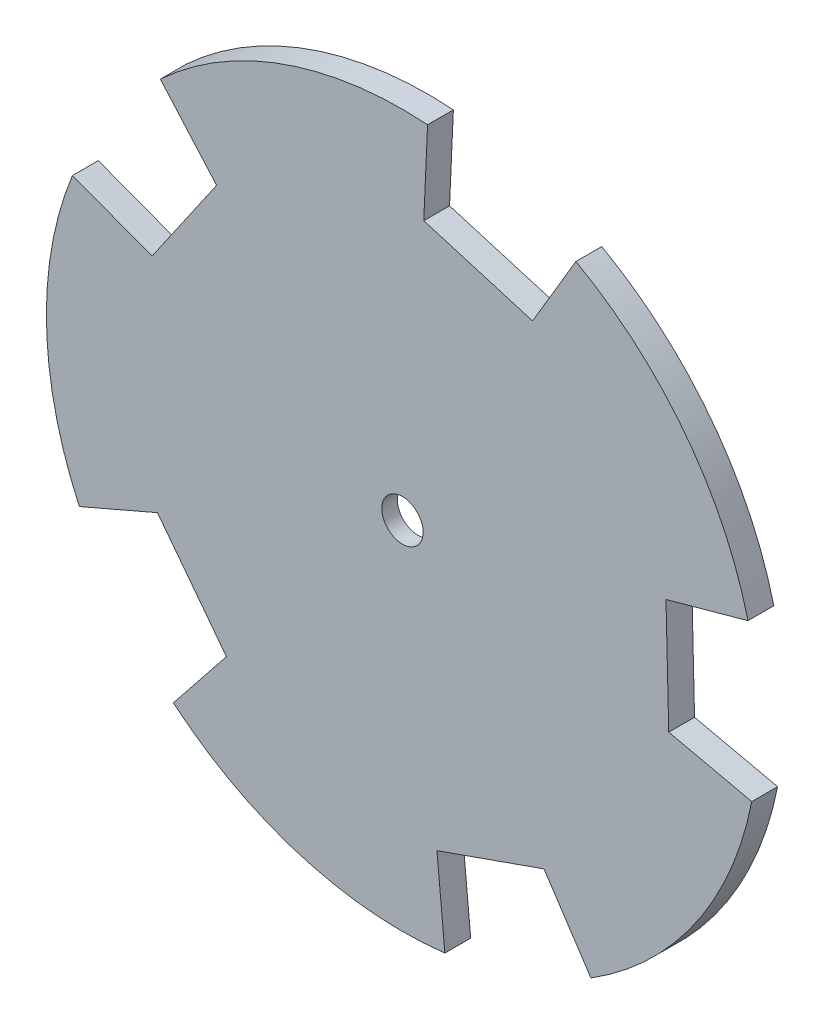
ISO-10303-21;
HEADER;
FILE_DESCRIPTION(('STEP AP214'),'2;1');
FILE_NAME('part.step','',(''),(''),'','','');
FILE_SCHEMA(('AUTOMOTIVE_DESIGN { 1 0 10303 214 1 1 1 1 }'));
ENDSEC;
DATA;
#1=APPLICATION_CONTEXT('core data for automotive mechanical design processes');
#2=APPLICATION_PROTOCOL_DEFINITION('international standard','automotive_design',2000,#1);
#3=PRODUCT_CONTEXT('',#1,'mechanical');
#4=PRODUCT('Part','Part','',(#3));
#5=PRODUCT_RELATED_PRODUCT_CATEGORY('part','',(#4));
#6=PRODUCT_DEFINITION_FORMATION('','',#4);
#7=PRODUCT_DEFINITION_CONTEXT('part definition',#1,'design');
#8=PRODUCT_DEFINITION('design','',#6,#7);
#9=PRODUCT_DEFINITION_SHAPE('','',#8);
#10=(LENGTH_UNIT() NAMED_UNIT(*) SI_UNIT(.MILLI.,.METRE.));
#11=(NAMED_UNIT(*) PLANE_ANGLE_UNIT() SI_UNIT($,.RADIAN.));
#12=(NAMED_UNIT(*) SI_UNIT($,.STERADIAN.) SOLID_ANGLE_UNIT());
#13=UNCERTAINTY_MEASURE_WITH_UNIT(LENGTH_MEASURE(1.E-05),#10,'distance_accuracy_value','');
#14=(GEOMETRIC_REPRESENTATION_CONTEXT(3) GLOBAL_UNCERTAINTY_ASSIGNED_CONTEXT((#13)) GLOBAL_UNIT_ASSIGNED_CONTEXT((#10,
#11,#12)) REPRESENTATION_CONTEXT('',''));
#15=CARTESIAN_POINT('',(0.,0.,0.));
#16=DIRECTION('',(0.,0.,1.));
#17=DIRECTION('',(1.,0.,0.));
#18=AXIS2_PLACEMENT_3D('',#15,#16,#17);
#19=CARTESIAN_POINT('',(0.,0.,1.5));
#20=DIRECTION('',(0.,0.,-1.));
#21=DIRECTION('',(-1.,0.,0.));
#22=AXIS2_PLACEMENT_3D('',#19,#20,#21);
#23=CYLINDRICAL_SURFACE('',#22,34.5);
#24=DIRECTION('',(0.,0.,-1.));
#25=VECTOR('',#24,1.);
#26=CARTESIAN_POINT('',(2.43311260345727,34.4140954124745,1.5));
#27=LINE('',#26,#25);
#28=CARTESIAN_POINT('',(2.43311260345727,34.4140954124745,1.5));
#29=VERTEX_POINT('',#28);
#30=CARTESIAN_POINT('',(2.43311260345728,34.4140954124745,-1.));
#31=VERTEX_POINT('',#30);
#32=EDGE_CURVE('E176',#29,#31,#27,.T.);
#33=ORIENTED_EDGE('',*,*,#32,.T.);
#34=CARTESIAN_POINT('',(0.,0.,-1.));
#35=DIRECTION('',(0.,0.,1.));
#36=DIRECTION('',(1.,0.,0.));
#37=AXIS2_PLACEMENT_3D('',#34,#35,#36);
#38=CIRCLE('',#37,34.5);
#39=CARTESIAN_POINT('',(-23.4602203749444,25.29561345291,-1.));
#40=VERTEX_POINT('',#39);
#41=EDGE_CURVE('E187',#31,#40,#38,.T.);
#42=ORIENTED_EDGE('',*,*,#41,.T.);
#43=DIRECTION('',(0.,0.,-1.));
#44=VECTOR('',#43,1.);
#45=CARTESIAN_POINT('',(-23.4602203749444,25.29561345291,1.5));
#46=LINE('',#45,#44);
#47=CARTESIAN_POINT('',(-23.4602203749444,25.29561345291,1.5));
#48=VERTEX_POINT('',#47);
#49=EDGE_CURVE('E11',#48,#40,#46,.T.);
#50=ORIENTED_EDGE('',*,*,#49,.F.);
#51=CARTESIAN_POINT('',(0.,0.,1.5));
#52=DIRECTION('',(0.,0.,1.));
#53=DIRECTION('',(1.,0.,0.));
#54=AXIS2_PLACEMENT_3D('',#51,#52,#53);
#55=CIRCLE('',#54,34.5);
#56=EDGE_CURVE('E247',#29,#48,#55,.T.);
#57=ORIENTED_EDGE('',*,*,#56,.F.);
#58=EDGE_LOOP('',(#33,#42,#50,#57));
#59=FACE_BOUND('',#58,.T.);
#60=ADVANCED_FACE('F35',(#59),#23,.T.);
#61=CARTESIAN_POINT('',(-23.4602203749444,25.29561345291,1.5));
#62=DIRECTION('',(0.750529244150338,0.660837236901131,0.));
#63=DIRECTION('',(-0.660837236901131,0.750529244150338,0.));
#64=AXIS2_PLACEMENT_3D('',#61,#62,#63);
#65=PLANE('',#64);
#66=ORIENTED_EDGE('',*,*,#49,.T.);
#67=DIRECTION('',(0.660837236901131,-0.750529244150338,0.));
#68=VECTOR('',#67,1.);
#69=CARTESIAN_POINT('',(-18.0108169167751,19.1065907554164,-1.));
#70=LINE('',#69,#68);
#71=CARTESIAN_POINT('',(-18.0108169167751,19.1065907554164,-1.00000000000003));
#72=VERTEX_POINT('',#71);
#73=EDGE_CURVE('E241',#40,#72,#70,.T.);
#74=ORIENTED_EDGE('',*,*,#73,.T.);
#75=DIRECTION('',(0.,0.,-1.));
#76=VECTOR('',#75,1.);
#77=CARTESIAN_POINT('',(-18.0108169167751,19.1065907554164,1.5));
#78=LINE('',#77,#76);
#79=CARTESIAN_POINT('',(-18.0108169167751,19.1065907554164,1.5));
#80=VERTEX_POINT('',#79);
#81=EDGE_CURVE('E42',#80,#72,#78,.T.);
#82=ORIENTED_EDGE('',*,*,#81,.F.);
#83=DIRECTION('',(0.660837236901131,-0.750529244150338,0.));
#84=VECTOR('',#83,1.);
#85=CARTESIAN_POINT('',(-23.4602203749444,25.29561345291,1.5));
#86=LINE('',#85,#84);
#87=EDGE_CURVE('E249',#48,#80,#86,.T.);
#88=ORIENTED_EDGE('',*,*,#87,.F.);
#89=EDGE_LOOP('',(#66,#74,#82,#88));
#90=FACE_BOUND('',#89,.T.);
#91=ADVANCED_FACE('F325',(#90),#65,.F.);
#92=CARTESIAN_POINT('',(-18.0108169167751,19.1065907554164,1.5));
#93=DIRECTION('',(0.823136368534445,-0.567843745053097,0.));
#94=DIRECTION('',(0.567843745053097,0.823136368534445,0.));
#95=AXIS2_PLACEMENT_3D('',#92,#93,#94);
#96=PLANE('',#95);
#97=ORIENTED_EDGE('',*,*,#81,.T.);
#98=DIRECTION('',(-0.567843745053097,-0.823136368534445,0.));
#99=VECTOR('',#98,1.);
#100=CARTESIAN_POINT('',(-24.2570981123591,10.0520907015375,-1.));
#101=LINE('',#100,#99);
#102=CARTESIAN_POINT('',(-24.2570981123591,10.0520907015375,-1.));
#103=VERTEX_POINT('',#102);
#104=EDGE_CURVE('E238',#72,#103,#101,.T.);
#105=ORIENTED_EDGE('',*,*,#104,.T.);
#106=DIRECTION('',(0.,0.,-1.));
#107=VECTOR('',#106,1.);
#108=CARTESIAN_POINT('',(-24.2570981123591,10.0520907015375,1.5));
#109=LINE('',#108,#107);
#110=CARTESIAN_POINT('',(-24.2570981123591,10.0520907015375,1.5));
#111=VERTEX_POINT('',#110);
#112=EDGE_CURVE('E315',#111,#103,#109,.T.);
#113=ORIENTED_EDGE('',*,*,#112,.F.);
#114=DIRECTION('',(-0.567843745053097,-0.823136368534445,0.));
#115=VECTOR('',#114,1.);
#116=CARTESIAN_POINT('',(-18.0108169167751,19.1065907554164,1.5));
#117=LINE('',#116,#115);
#118=EDGE_CURVE('E251',#80,#111,#117,.T.);
#119=ORIENTED_EDGE('',*,*,#118,.F.);
#120=EDGE_LOOP('',(#97,#105,#113,#119));
#121=FACE_BOUND('',#120,.T.);
#122=ADVANCED_FACE('F320',(#121),#96,.F.);
#123=CARTESIAN_POINT('',(-24.2570981123591,10.0520907015375,1.5));
#124=DIRECTION('',(-0.351249456885061,-0.936281912159981,0.));
#125=DIRECTION('',(0.936281912159981,-0.351249456885061,0.));
#126=AXIS2_PLACEMENT_3D('',#123,#124,#125);
#127=PLANE('',#126);
#128=ORIENTED_EDGE('',*,*,#112,.T.);
#129=DIRECTION('',(-0.93628191215998,0.351249456885062,0.));
#130=VECTOR('',#129,1.);
#131=CARTESIAN_POINT('',(-31.9778765507409,12.9485679248934,-1.));
#132=LINE('',#131,#130);
#133=CARTESIAN_POINT('',(-31.9778765507409,12.9485679248934,-1.));
#134=VERTEX_POINT('',#133);
#135=EDGE_CURVE('E235',#103,#134,#132,.T.);
#136=ORIENTED_EDGE('',*,*,#135,.T.);
#137=DIRECTION('',(0.,0.,-1.));
#138=VECTOR('',#137,1.);
#139=CARTESIAN_POINT('',(-31.9778765507409,12.9485679248933,1.5));
#140=LINE('',#139,#138);
#141=CARTESIAN_POINT('',(-31.9778765507409,12.9485679248933,1.5));
#142=VERTEX_POINT('',#141);
#143=EDGE_CURVE('E313',#142,#134,#140,.T.);
#144=ORIENTED_EDGE('',*,*,#143,.F.);
#145=DIRECTION('',(-0.93628191215998,0.351249456885061,0.));
#146=VECTOR('',#145,1.);
#147=CARTESIAN_POINT('',(-24.2570981123591,10.0520907015375,1.5));
#148=LINE('',#147,#146);
#149=EDGE_CURVE('E253',#111,#142,#148,.T.);
#150=ORIENTED_EDGE('',*,*,#149,.F.);
#151=EDGE_LOOP('',(#128,#136,#144,#150));
#152=FACE_BOUND('',#151,.T.);
#153=ADVANCED_FACE('F373',(#152),#127,.F.);
#154=CARTESIAN_POINT('',(0.,0.,1.5));
#155=DIRECTION('',(0.,0.,-1.));
#156=DIRECTION('',(-1.,0.,0.));
#157=AXIS2_PLACEMENT_3D('',#154,#155,#156);
#158=CYLINDRICAL_SURFACE('',#157,34.5);
#159=ORIENTED_EDGE('',*,*,#143,.T.);
#160=CARTESIAN_POINT('',(0.,0.,-1.));
#161=DIRECTION('',(0.,0.,1.));
#162=DIRECTION('',(1.,0.,0.));
#163=AXIS2_PLACEMENT_3D('',#160,#161,#162);
#164=CIRCLE('',#163,34.5);
#165=CARTESIAN_POINT('',(-31.3071647957126,-14.4952210212226,-1.));
#166=VERTEX_POINT('',#165);
#167=EDGE_CURVE('E232',#134,#166,#164,.T.);
#168=ORIENTED_EDGE('',*,*,#167,.T.);
#169=DIRECTION('',(0.,0.,-1.));
#170=VECTOR('',#169,1.);
#171=CARTESIAN_POINT('',(-31.3071647957126,-14.4952210212225,1.5));
#172=LINE('',#171,#170);
#173=CARTESIAN_POINT('',(-31.3071647957126,-14.4952210212225,1.5));
#174=VERTEX_POINT('',#173);
#175=EDGE_CURVE('E311',#174,#166,#172,.T.);
#176=ORIENTED_EDGE('',*,*,#175,.F.);
#177=CARTESIAN_POINT('',(0.,0.,1.5));
#178=DIRECTION('',(0.,0.,1.));
#179=DIRECTION('',(1.,0.,0.));
#180=AXIS2_PLACEMENT_3D('',#177,#178,#179);
#181=CIRCLE('',#180,34.5);
#182=EDGE_CURVE('E255',#142,#174,#181,.T.);
#183=ORIENTED_EDGE('',*,*,#182,.F.);
#184=EDGE_LOOP('',(#159,#168,#176,#183));
#185=FACE_BOUND('',#184,.T.);
#186=ADVANCED_FACE('F378',(#185),#158,.T.);
#187=CARTESIAN_POINT('',(-31.3071647957126,-14.4952210212226,1.5));
#188=DIRECTION('',(-0.396567269147469,0.918005665037487,0.));
#189=DIRECTION('',(-0.918005665037487,-0.396567269147469,0.));
#190=AXIS2_PLACEMENT_3D('',#187,#188,#189);
#191=PLANE('',#190);
#192=ORIENTED_EDGE('',*,*,#175,.T.);
#193=DIRECTION('',(0.918005665037488,0.396567269147467,0.));
#194=VECTOR('',#193,1.);
#195=CARTESIAN_POINT('',(-23.7370961519827,-11.225043544507,-1.));
#196=LINE('',#195,#194);
#197=CARTESIAN_POINT('',(-23.7370961519827,-11.225043544507,-1.));
#198=VERTEX_POINT('',#197);
#199=EDGE_CURVE('E229',#166,#198,#196,.T.);
#200=ORIENTED_EDGE('',*,*,#199,.T.);
#201=DIRECTION('',(0.,0.,-1.));
#202=VECTOR('',#201,1.);
#203=CARTESIAN_POINT('',(-23.7370961519827,-11.225043544507,1.5));
#204=LINE('',#203,#202);
#205=CARTESIAN_POINT('',(-23.7370961519827,-11.225043544507,1.5));
#206=VERTEX_POINT('',#205);
#207=EDGE_CURVE('E309',#206,#198,#204,.T.);
#208=ORIENTED_EDGE('',*,*,#207,.F.);
#209=DIRECTION('',(0.918005665037487,0.396567269147469,0.));
#210=VECTOR('',#209,1.);
#211=CARTESIAN_POINT('',(-31.3071647957126,-14.4952210212226,1.5));
#212=LINE('',#211,#210);
#213=EDGE_CURVE('E257',#174,#206,#212,.T.);
#214=ORIENTED_EDGE('',*,*,#213,.F.);
#215=EDGE_LOOP('',(#192,#200,#208,#214));
#216=FACE_BOUND('',#215,.T.);
#217=ADVANCED_FACE('F382',(#216),#191,.F.);
#218=CARTESIAN_POINT('',(-23.7370961519827,-11.225043544507,1.5));
#219=DIRECTION('',(0.794414620535413,0.607375839723293,0.));
#220=DIRECTION('',(-0.607375839723293,0.794414620535413,0.));
#221=AXIS2_PLACEMENT_3D('',#218,#219,#220);
#222=PLANE('',#221);
#223=ORIENTED_EDGE('',*,*,#207,.T.);
#224=DIRECTION('',(0.607375839723293,-0.794414620535413,0.));
#225=VECTOR('',#224,1.);
#226=CARTESIAN_POINT('',(-17.0559619150265,-19.9636043703966,-1.));
#227=LINE('',#226,#225);
#228=CARTESIAN_POINT('',(-17.0559619150265,-19.9636043703966,-1.));
#229=VERTEX_POINT('',#228);
#230=EDGE_CURVE('E226',#198,#229,#227,.T.);
#231=ORIENTED_EDGE('',*,*,#230,.T.);
#232=DIRECTION('',(0.,0.,-1.));
#233=VECTOR('',#232,1.);
#234=CARTESIAN_POINT('',(-17.0559619150265,-19.9636043703966,1.5));
#235=LINE('',#234,#233);
#236=CARTESIAN_POINT('',(-17.0559619150265,-19.9636043703966,1.5));
#237=VERTEX_POINT('',#236);
#238=EDGE_CURVE('E307',#237,#229,#235,.T.);
#239=ORIENTED_EDGE('',*,*,#238,.F.);
#240=DIRECTION('',(0.607375839723293,-0.794414620535413,0.));
#241=VECTOR('',#240,1.);
#242=CARTESIAN_POINT('',(-23.7370961519827,-11.225043544507,1.5));
#243=LINE('',#242,#241);
#244=EDGE_CURVE('E259',#206,#237,#243,.T.);
#245=ORIENTED_EDGE('',*,*,#244,.F.);
#246=EDGE_LOOP('',(#223,#231,#239,#245));
#247=FACE_BOUND('',#246,.T.);
#248=ADVANCED_FACE('F386',(#247),#222,.F.);
#249=CARTESIAN_POINT('',(-17.0559619150265,-19.9636043703966,1.5));
#250=DIRECTION('',(0.781914962206584,-0.623385107198974,0.));
#251=DIRECTION('',(0.623385107198974,0.781914962206584,0.));
#252=AXIS2_PLACEMENT_3D('',#249,#250,#251);
#253=PLANE('',#252);
#254=ORIENTED_EDGE('',*,*,#238,.T.);
#255=DIRECTION('',(-0.623385107198975,-0.781914962206583,0.));
#256=VECTOR('',#255,1.);
#257=CARTESIAN_POINT('',(-22.1965271998632,-26.4114403292538,-1.));
#258=LINE('',#257,#256);
#259=CARTESIAN_POINT('',(-22.1965271998632,-26.4114403292538,-1.));
#260=VERTEX_POINT('',#259);
#261=EDGE_CURVE('E223',#229,#260,#258,.T.);
#262=ORIENTED_EDGE('',*,*,#261,.T.);
#263=DIRECTION('',(0.,0.,-1.));
#264=VECTOR('',#263,1.);
#265=CARTESIAN_POINT('',(-22.1965271998632,-26.4114403292538,1.5));
#266=LINE('',#265,#264);
#267=CARTESIAN_POINT('',(-22.1965271998632,-26.4114403292538,1.5));
#268=VERTEX_POINT('',#267);
#269=EDGE_CURVE('E305',#268,#260,#266,.T.);
#270=ORIENTED_EDGE('',*,*,#269,.F.);
#271=DIRECTION('',(-0.623385107198974,-0.781914962206584,0.));
#272=VECTOR('',#271,1.);
#273=CARTESIAN_POINT('',(-17.0559619150265,-19.9636043703966,1.5));
#274=LINE('',#273,#272);
#275=EDGE_CURVE('E261',#237,#268,#274,.T.);
#276=ORIENTED_EDGE('',*,*,#275,.F.);
#277=EDGE_LOOP('',(#254,#262,#270,#276));
#278=FACE_BOUND('',#277,.T.);
#279=ADVANCED_FACE('F390',(#278),#253,.F.);
#280=CARTESIAN_POINT('',(0.,0.,1.5));
#281=DIRECTION('',(0.,0.,-1.));
#282=DIRECTION('',(-1.,0.,0.));
#283=AXIS2_PLACEMENT_3D('',#280,#281,#282);
#284=CYLINDRICAL_SURFACE('',#283,34.5);
#285=ORIENTED_EDGE('',*,*,#269,.T.);
#286=CARTESIAN_POINT('',(0.,0.,-1.));
#287=DIRECTION('',(0.,0.,1.));
#288=DIRECTION('',(1.,0.,0.));
#289=AXIS2_PLACEMENT_3D('',#286,#287,#288);
#290=CIRCLE('',#289,34.5);
#291=CARTESIAN_POINT('',(4.11132843980005,-34.2541527184674,-1.));
#292=VERTEX_POINT('',#291);
#293=EDGE_CURVE('E220',#260,#292,#290,.T.);
#294=ORIENTED_EDGE('',*,*,#293,.T.);
#295=DIRECTION('',(0.,0.,-1.));
#296=VECTOR('',#295,1.);
#297=CARTESIAN_POINT('',(4.11132843980004,-34.2541527184674,1.5));
#298=LINE('',#297,#296);
#299=CARTESIAN_POINT('',(4.11132843980004,-34.2541527184674,1.5));
#300=VERTEX_POINT('',#299);
#301=EDGE_CURVE('E303',#300,#292,#298,.T.);
#302=ORIENTED_EDGE('',*,*,#301,.F.);
#303=CARTESIAN_POINT('',(0.,0.,1.5));
#304=DIRECTION('',(0.,0.,1.));
#305=DIRECTION('',(1.,0.,0.));
#306=AXIS2_PLACEMENT_3D('',#303,#304,#305);
#307=CIRCLE('',#306,34.5);
#308=EDGE_CURVE('E263',#268,#300,#307,.T.);
#309=ORIENTED_EDGE('',*,*,#308,.F.);
#310=EDGE_LOOP('',(#285,#294,#302,#309));
#311=FACE_BOUND('',#310,.T.);
#312=ADVANCED_FACE('F394',(#311),#284,.T.);
#313=CARTESIAN_POINT('',(4.11132843980004,-34.2541527184674,1.5));
#314=DIRECTION('',(-0.9956212953092,-0.0934785340430176,0.));
#315=DIRECTION('',(0.0934785340430176,-0.9956212953092,0.));
#316=AXIS2_PLACEMENT_3D('',#313,#314,#315);
#317=PLANE('',#316);
#318=ORIENTED_EDGE('',*,*,#301,.T.);
#319=DIRECTION('',(-0.0934785340430177,0.9956212953092,0.));
#320=VECTOR('',#319,1.);
#321=CARTESIAN_POINT('',(3.34048470062553,-26.0440491911192,-1.));
#322=LINE('',#321,#320);
#323=CARTESIAN_POINT('',(3.34048470062553,-26.0440491911192,-1.));
#324=VERTEX_POINT('',#323);
#325=EDGE_CURVE('E217',#292,#324,#322,.T.);
#326=ORIENTED_EDGE('',*,*,#325,.T.);
#327=DIRECTION('',(0.,0.,-1.));
#328=VECTOR('',#327,1.);
#329=CARTESIAN_POINT('',(3.34048470062553,-26.0440491911192,1.5));
#330=LINE('',#329,#328);
#331=CARTESIAN_POINT('',(3.34048470062553,-26.0440491911192,1.5));
#332=VERTEX_POINT('',#331);
#333=EDGE_CURVE('E301',#332,#324,#330,.T.);
#334=ORIENTED_EDGE('',*,*,#333,.F.);
#335=DIRECTION('',(-0.0934785340430176,0.9956212953092,0.));
#336=VECTOR('',#335,1.);
#337=CARTESIAN_POINT('',(4.11132843980004,-34.2541527184674,1.5));
#338=LINE('',#337,#336);
#339=EDGE_CURVE('E265',#300,#332,#338,.T.);
#340=ORIENTED_EDGE('',*,*,#339,.F.);
#341=EDGE_LOOP('',(#318,#326,#334,#340));
#342=FACE_BOUND('',#341,.T.);
#343=ADVANCED_FACE('F398',(#342),#317,.F.);
#344=CARTESIAN_POINT('',(3.34048470062553,-26.0440491911192,1.5));
#345=DIRECTION('',(-0.332161131883714,0.943222657947597,0.));
#346=DIRECTION('',(-0.943222657947597,-0.332161131883714,0.));
#347=AXIS2_PLACEMENT_3D('',#344,#345,#346);
#348=PLANE('',#347);
#349=ORIENTED_EDGE('',*,*,#333,.T.);
#350=DIRECTION('',(0.943222657947597,0.332161131883714,0.));
#351=VECTOR('',#350,1.);
#352=CARTESIAN_POINT('',(13.7159339380491,-22.3902767403984,-1.));
#353=LINE('',#352,#351);
#354=CARTESIAN_POINT('',(13.7159339380491,-22.3902767403984,-1.));
#355=VERTEX_POINT('',#354);
#356=EDGE_CURVE('E214',#324,#355,#353,.T.);
#357=ORIENTED_EDGE('',*,*,#356,.T.);
#358=DIRECTION('',(0.,0.,-1.));
#359=VECTOR('',#358,1.);
#360=CARTESIAN_POINT('',(13.7159339380491,-22.3902767403984,1.5));
#361=LINE('',#360,#359);
#362=CARTESIAN_POINT('',(13.7159339380491,-22.3902767403984,1.5));
#363=VERTEX_POINT('',#362);
#364=EDGE_CURVE('E299',#363,#355,#361,.T.);
#365=ORIENTED_EDGE('',*,*,#364,.F.);
#366=DIRECTION('',(0.943222657947597,0.332161131883714,0.));
#367=VECTOR('',#366,1.);
#368=CARTESIAN_POINT('',(3.34048470062553,-26.0440491911192,1.5));
#369=LINE('',#368,#367);
#370=EDGE_CURVE('E267',#332,#363,#369,.T.);
#371=ORIENTED_EDGE('',*,*,#370,.F.);
#372=EDGE_LOOP('',(#349,#357,#365,#371));
#373=FACE_BOUND('',#372,.T.);
#374=ADVANCED_FACE('F402',(#373),#348,.F.);
#375=CARTESIAN_POINT('',(13.7159339380491,-22.3902767403984,1.5));
#376=DIRECTION('',(0.834499479840814,0.551008727830522,0.));
#377=DIRECTION('',(-0.551008727830522,0.834499479840815,0.));
#378=AXIS2_PLACEMENT_3D('',#375,#376,#377);
#379=PLANE('',#378);
#380=ORIENTED_EDGE('',*,*,#364,.T.);
#381=DIRECTION('',(0.551008727830522,-0.834499479840814,0.));
#382=VECTOR('',#381,1.);
#383=CARTESIAN_POINT('',(18.259668309014,-29.2717357402117,-1.));
#384=LINE('',#383,#382);
#385=CARTESIAN_POINT('',(18.259668309014,-29.2717357402117,-1.));
#386=VERTEX_POINT('',#385);
#387=EDGE_CURVE('E211',#355,#386,#384,.T.);
#388=ORIENTED_EDGE('',*,*,#387,.T.);
#389=DIRECTION('',(0.,0.,-1.));
#390=VECTOR('',#389,1.);
#391=CARTESIAN_POINT('',(18.259668309014,-29.2717357402117,1.5));
#392=LINE('',#391,#390);
#393=CARTESIAN_POINT('',(18.259668309014,-29.2717357402117,1.5));
#394=VERTEX_POINT('',#393);
#395=EDGE_CURVE('E297',#394,#386,#392,.T.);
#396=ORIENTED_EDGE('',*,*,#395,.F.);
#397=DIRECTION('',(0.551008727830522,-0.834499479840815,0.));
#398=VECTOR('',#397,1.);
#399=CARTESIAN_POINT('',(13.7159339380491,-22.3902767403984,1.5));
#400=LINE('',#399,#398);
#401=EDGE_CURVE('E269',#363,#394,#400,.T.);
#402=ORIENTED_EDGE('',*,*,#401,.F.);
#403=EDGE_LOOP('',(#380,#388,#396,#402));
#404=FACE_BOUND('',#403,.T.);
#405=ADVANCED_FACE('F406',(#404),#379,.F.);
#406=CARTESIAN_POINT('',(0.,0.,1.5));
#407=DIRECTION('',(0.,0.,-1.));
#408=DIRECTION('',(-1.,0.,0.));
#409=AXIS2_PLACEMENT_3D('',#406,#407,#408);
#410=CYLINDRICAL_SURFACE('',#409,34.5);
#411=ORIENTED_EDGE('',*,*,#395,.T.);
#412=CARTESIAN_POINT('',(0.,0.,-1.));
#413=DIRECTION('',(0.,0.,1.));
#414=DIRECTION('',(1.,0.,0.));
#415=AXIS2_PLACEMENT_3D('',#412,#413,#414);
#416=CIRCLE('',#415,34.5);
#417=CARTESIAN_POINT('',(33.8481055104231,-6.67500961461973,-1.));
#418=VERTEX_POINT('',#417);
#419=EDGE_CURVE('E208',#386,#418,#416,.T.);
#420=ORIENTED_EDGE('',*,*,#419,.T.);
#421=DIRECTION('',(0.,0.,-1.));
#422=VECTOR('',#421,1.);
#423=CARTESIAN_POINT('',(33.8481055104231,-6.67500961461974,1.5));
#424=LINE('',#423,#422);
#425=CARTESIAN_POINT('',(33.8481055104231,-6.67500961461974,1.5));
#426=VERTEX_POINT('',#425);
#427=EDGE_CURVE('E295',#426,#418,#424,.T.);
#428=ORIENTED_EDGE('',*,*,#427,.F.);
#429=CARTESIAN_POINT('',(0.,0.,1.5));
#430=DIRECTION('',(0.,0.,1.));
#431=DIRECTION('',(1.,0.,0.));
#432=AXIS2_PLACEMENT_3D('',#429,#430,#431);
#433=CIRCLE('',#432,34.5);
#434=EDGE_CURVE('E271',#394,#426,#433,.T.);
#435=ORIENTED_EDGE('',*,*,#434,.F.);
#436=EDGE_LOOP('',(#411,#420,#428,#435));
#437=FACE_BOUND('',#436,.T.);
#438=ADVANCED_FACE('F410',(#437),#410,.T.);
#439=CARTESIAN_POINT('',(33.8481055104231,-6.67500961461974,1.5));
#440=DIRECTION('',(-0.218760531276808,-0.975778576294586,0.));
#441=DIRECTION('',(0.975778576294586,-0.218760531276808,0.));
#442=AXIS2_PLACEMENT_3D('',#439,#440,#441);
#443=PLANE('',#442);
#444=ORIENTED_EDGE('',*,*,#427,.T.);
#445=DIRECTION('',(-0.975778576294586,0.218760531276808,0.));
#446=VECTOR('',#445,1.);
#447=CARTESIAN_POINT('',(25.8016292358683,-4.87106406027871,-1.));
#448=LINE('',#447,#446);
#449=CARTESIAN_POINT('',(25.8016292358683,-4.87106406027871,-1.));
#450=VERTEX_POINT('',#449);
#451=EDGE_CURVE('E205',#418,#450,#448,.T.);
#452=ORIENTED_EDGE('',*,*,#451,.T.);
#453=DIRECTION('',(0.,0.,-1.));
#454=VECTOR('',#453,1.);
#455=CARTESIAN_POINT('',(25.8016292358683,-4.87106406027871,1.5));
#456=LINE('',#455,#454);
#457=CARTESIAN_POINT('',(25.8016292358683,-4.87106406027871,1.5));
#458=VERTEX_POINT('',#457);
#459=EDGE_CURVE('E293',#458,#450,#456,.T.);
#460=ORIENTED_EDGE('',*,*,#459,.F.);
#461=DIRECTION('',(-0.975778576294586,0.218760531276808,0.));
#462=VECTOR('',#461,1.);
#463=CARTESIAN_POINT('',(33.8481055104231,-6.67500961461974,1.5));
#464=LINE('',#463,#462);
#465=EDGE_CURVE('E273',#426,#458,#464,.T.);
#466=ORIENTED_EDGE('',*,*,#465,.F.);
#467=EDGE_LOOP('',(#444,#452,#460,#466));
#468=FACE_BOUND('',#467,.T.);
#469=ADVANCED_FACE('F414',(#468),#443,.F.);
#470=CARTESIAN_POINT('',(25.8016292358683,-4.87106406027871,1.5));
#471=DIRECTION('',(-0.999701489781183,-0.0244321781526672,0.));
#472=DIRECTION('',(0.0244321781526672,-0.999701489781183,0.));
#473=AXIS2_PLACEMENT_3D('',#470,#471,#472);
#474=PLANE('',#473);
#475=ORIENTED_EDGE('',*,*,#459,.T.);
#476=DIRECTION('',(-0.0244321781526672,0.999701489781183,0.));
#477=VECTOR('',#476,1.);
#478=CARTESIAN_POINT('',(25.532875276189,6.1256523273143,-1.));
#479=LINE('',#478,#477);
#480=CARTESIAN_POINT('',(25.532875276189,6.1256523273143,-1.));
#481=VERTEX_POINT('',#480);
#482=EDGE_CURVE('E202',#450,#481,#479,.T.);
#483=ORIENTED_EDGE('',*,*,#482,.T.);
#484=DIRECTION('',(0.,0.,-1.));
#485=VECTOR('',#484,1.);
#486=CARTESIAN_POINT('',(25.532875276189,6.1256523273143,1.5));
#487=LINE('',#486,#485);
#488=CARTESIAN_POINT('',(25.532875276189,6.1256523273143,1.5));
#489=VERTEX_POINT('',#488);
#490=EDGE_CURVE('E291',#489,#481,#487,.T.);
#491=ORIENTED_EDGE('',*,*,#490,.F.);
#492=DIRECTION('',(-0.0244321781526672,0.999701489781183,0.));
#493=VECTOR('',#492,1.);
#494=CARTESIAN_POINT('',(25.8016292358683,-4.87106406027871,1.5));
#495=LINE('',#494,#493);
#496=EDGE_CURVE('E275',#458,#489,#495,.T.);
#497=ORIENTED_EDGE('',*,*,#496,.F.);
#498=EDGE_LOOP('',(#475,#483,#491,#497));
#499=FACE_BOUND('',#498,.T.);
#500=ADVANCED_FACE('F418',(#499),#474,.F.);
#501=CARTESIAN_POINT('',(25.532875276189,6.1256523273143,1.5));
#502=DIRECTION('',(-0.266165920070857,0.963927229096074,0.));
#503=DIRECTION('',(-0.963927229096074,-0.266165920070857,0.));
#504=AXIS2_PLACEMENT_3D('',#501,#502,#503);
#505=PLANE('',#504);
#506=ORIENTED_EDGE('',*,*,#490,.T.);
#507=DIRECTION('',(0.963927229096073,0.266165920070858,0.));
#508=VECTOR('',#507,1.);
#509=CARTESIAN_POINT('',(33.4816228381331,8.32051273209801,-1.));
#510=LINE('',#509,#508);
#511=CARTESIAN_POINT('',(33.4816228381331,8.32051273209801,-1.));
#512=VERTEX_POINT('',#511);
#513=EDGE_CURVE('E199',#481,#512,#510,.T.);
#514=ORIENTED_EDGE('',*,*,#513,.T.);
#515=DIRECTION('',(0.,0.,-1.));
#516=VECTOR('',#515,1.);
#517=CARTESIAN_POINT('',(33.4816228381331,8.320512732098,1.5));
#518=LINE('',#517,#516);
#519=CARTESIAN_POINT('',(33.4816228381331,8.320512732098,1.5));
#520=VERTEX_POINT('',#519);
#521=EDGE_CURVE('E289',#520,#512,#518,.T.);
#522=ORIENTED_EDGE('',*,*,#521,.F.);
#523=DIRECTION('',(0.963927229096073,0.266165920070857,0.));
#524=VECTOR('',#523,1.);
#525=CARTESIAN_POINT('',(25.532875276189,6.1256523273143,1.5));
#526=LINE('',#525,#524);
#527=EDGE_CURVE('E277',#489,#520,#526,.T.);
#528=ORIENTED_EDGE('',*,*,#527,.F.);
#529=EDGE_LOOP('',(#506,#514,#522,#528));
#530=FACE_BOUND('',#529,.T.);
#531=ADVANCED_FACE('F422',(#530),#505,.F.);
#532=CARTESIAN_POINT('',(0.,0.,1.5));
#533=DIRECTION('',(0.,0.,-1.));
#534=DIRECTION('',(-1.,0.,0.));
#535=AXIS2_PLACEMENT_3D('',#532,#533,#534);
#536=CYLINDRICAL_SURFACE('',#535,34.5);
#537=ORIENTED_EDGE('',*,*,#521,.T.);
#538=CARTESIAN_POINT('',(0.,0.,-1.));
#539=DIRECTION('',(0.,0.,1.));
#540=DIRECTION('',(1.,0.,0.));
#541=AXIS2_PLACEMENT_3D('',#538,#539,#540);
#542=CIRCLE('',#541,34.5);
#543=CARTESIAN_POINT('',(16.8079512204343,30.1287699013999,-1.));
#544=VERTEX_POINT('',#543);
#545=EDGE_CURVE('E193',#512,#544,#542,.T.);
#546=ORIENTED_EDGE('',*,*,#545,.T.);
#547=DIRECTION('',(0.,0.,-1.));
#548=VECTOR('',#547,1.);
#549=CARTESIAN_POINT('',(16.8079512204343,30.1287699013999,1.5));
#550=LINE('',#549,#548);
#551=CARTESIAN_POINT('',(16.8079512204343,30.1287699013999,1.5));
#552=VERTEX_POINT('',#551);
#553=EDGE_CURVE('E287',#552,#544,#550,.T.);
#554=ORIENTED_EDGE('',*,*,#553,.F.);
#555=CARTESIAN_POINT('',(0.,0.,1.5));
#556=DIRECTION('',(0.,0.,1.));
#557=DIRECTION('',(1.,0.,0.));
#558=AXIS2_PLACEMENT_3D('',#555,#556,#557);
#559=CIRCLE('',#558,34.5);
#560=EDGE_CURVE('E279',#520,#552,#559,.T.);
#561=ORIENTED_EDGE('',*,*,#560,.F.);
#562=EDGE_LOOP('',(#537,#546,#554,#561));
#563=FACE_BOUND('',#562,.T.);
#564=ADVANCED_FACE('F426',(#563),#536,.T.);
#565=CARTESIAN_POINT('',(16.8079512204343,30.1287699013999,1.5));
#566=DIRECTION('',(0.860419851583142,-0.509585791601025,0.));
#567=DIRECTION('',(0.509585791601025,0.860419851583143,0.));
#568=AXIS2_PLACEMENT_3D('',#565,#566,#567);
#569=PLANE('',#568);
#570=ORIENTED_EDGE('',*,*,#553,.T.);
#571=DIRECTION('',(-0.509585791601025,-0.860419851583143,0.));
#572=VECTOR('',#571,1.);
#573=CARTESIAN_POINT('',(12.6057991322643,23.0335660404888,-1.));
#574=LINE('',#573,#572);
#575=CARTESIAN_POINT('',(12.6057991322643,23.0335660404888,-1.));
#576=VERTEX_POINT('',#575);
#577=EDGE_CURVE('E191',#544,#576,#574,.T.);
#578=ORIENTED_EDGE('',*,*,#577,.T.);
#579=DIRECTION('',(0.,0.,-1.));
#580=VECTOR('',#579,1.);
#581=CARTESIAN_POINT('',(12.6057991322643,23.0335660404888,1.5));
#582=LINE('',#581,#580);
#583=CARTESIAN_POINT('',(12.6057991322643,23.0335660404888,1.5));
#584=VERTEX_POINT('',#583);
#585=EDGE_CURVE('E175',#584,#576,#582,.T.);
#586=ORIENTED_EDGE('',*,*,#585,.F.);
#587=DIRECTION('',(-0.509585791601025,-0.860419851583142,0.));
#588=VECTOR('',#587,1.);
#589=CARTESIAN_POINT('',(16.8079512204343,30.1287699013999,1.5));
#590=LINE('',#589,#588);
#591=EDGE_CURVE('E281',#552,#584,#590,.T.);
#592=ORIENTED_EDGE('',*,*,#591,.F.);
#593=EDGE_LOOP('',(#570,#578,#586,#592));
#594=FACE_BOUND('',#593,.T.);
#595=ADVANCED_FACE('F430',(#594),#569,.F.);
#596=CARTESIAN_POINT('',(12.6057991322643,23.0335660404888,1.5));
#597=DIRECTION('',(-0.285688367404971,-0.958322574465134,0.));
#598=DIRECTION('',(0.958322574465134,-0.285688367404971,0.));
#599=AXIS2_PLACEMENT_3D('',#596,#597,#598);
#600=PLANE('',#599);
#601=ORIENTED_EDGE('',*,*,#585,.T.);
#602=DIRECTION('',(-0.958322574465134,0.285688367404971,0.));
#603=VECTOR('',#602,1.);
#604=CARTESIAN_POINT('',(2.06425081314778,26.1761380819435,-1.));
#605=LINE('',#604,#603);
#606=CARTESIAN_POINT('',(2.06425081314778,26.1761380819435,-1.));
#607=VERTEX_POINT('',#606);
#608=EDGE_CURVE('E183',#576,#607,#605,.T.);
#609=ORIENTED_EDGE('',*,*,#608,.T.);
#610=DIRECTION('',(0.,0.,-1.));
#611=VECTOR('',#610,1.);
#612=CARTESIAN_POINT('',(2.06425081314778,26.1761380819435,1.5));
#613=LINE('',#612,#611);
#614=CARTESIAN_POINT('',(2.06425081314778,26.1761380819435,1.5));
#615=VERTEX_POINT('',#614);
#616=EDGE_CURVE('E169',#615,#607,#613,.T.);
#617=ORIENTED_EDGE('',*,*,#616,.F.);
#618=DIRECTION('',(-0.958322574465134,0.285688367404971,0.));
#619=VECTOR('',#618,1.);
#620=CARTESIAN_POINT('',(12.6057991322643,23.0335660404888,1.5));
#621=LINE('',#620,#619);
#622=EDGE_CURVE('E54',#584,#615,#621,.T.);
#623=ORIENTED_EDGE('',*,*,#622,.F.);
#624=EDGE_LOOP('',(#601,#609,#617,#623));
#625=FACE_BOUND('',#624,.T.);
#626=ADVANCED_FACE('F189',(#625),#600,.F.);
#627=CARTESIAN_POINT('',(2.06425081314778,26.1761380819435,1.5));
#628=DIRECTION('',(-0.99899906509149,0.0447310624323676,0.));
#629=DIRECTION('',(-0.0447310624323676,-0.99899906509149,0.));
#630=AXIS2_PLACEMENT_3D('',#627,#628,#629);
#631=PLANE('',#630);
#632=ORIENTED_EDGE('',*,*,#616,.T.);
#633=DIRECTION('',(0.044731062432368,0.99899906509149,0.));
#634=VECTOR('',#633,1.);
#635=CARTESIAN_POINT('',(2.43311260345728,34.4140954124745,-1.));
#636=LINE('',#635,#634);
#637=EDGE_CURVE('E172',#607,#31,#636,.T.);
#638=ORIENTED_EDGE('',*,*,#637,.T.);
#639=ORIENTED_EDGE('',*,*,#32,.F.);
#640=DIRECTION('',(0.0447310624323676,0.99899906509149,0.));
#641=VECTOR('',#640,1.);
#642=CARTESIAN_POINT('',(2.06425081314778,26.1761380819435,1.5));
#643=LINE('',#642,#641);
#644=EDGE_CURVE('E49',#615,#29,#643,.T.);
#645=ORIENTED_EDGE('',*,*,#644,.F.);
#646=EDGE_LOOP('',(#632,#638,#639,#645));
#647=FACE_BOUND('',#646,.T.);
#648=ADVANCED_FACE('F171',(#647),#631,.F.);
#649=CARTESIAN_POINT('',(0.,0.,1.5));
#650=DIRECTION('',(0.,0.,1.));
#651=DIRECTION('',(1.,0.,0.));
#652=AXIS2_PLACEMENT_3D('',#649,#650,#651);
#653=PLANE('',#652);
#654=CARTESIAN_POINT('',(0.,0.,1.5));
#655=DIRECTION('',(0.,0.,-1.));
#656=DIRECTION('',(-1.,0.,0.));
#657=AXIS2_PLACEMENT_3D('',#654,#655,#656);
#658=CIRCLE('',#657,2.);
#659=CARTESIAN_POINT('',(-2.,0.,1.5));
#660=VERTEX_POINT('',#659);
#661=EDGE_CURVE('E331',#660,#660,#658,.T.);
#662=ORIENTED_EDGE('',*,*,#661,.T.);
#663=EDGE_LOOP('',(#662));
#664=FACE_BOUND('',#663,.T.);
#665=ORIENTED_EDGE('',*,*,#56,.T.);
#666=ORIENTED_EDGE('',*,*,#87,.T.);
#667=ORIENTED_EDGE('',*,*,#118,.T.);
#668=ORIENTED_EDGE('',*,*,#149,.T.);
#669=ORIENTED_EDGE('',*,*,#182,.T.);
#670=ORIENTED_EDGE('',*,*,#213,.T.);
#671=ORIENTED_EDGE('',*,*,#244,.T.);
#672=ORIENTED_EDGE('',*,*,#275,.T.);
#673=ORIENTED_EDGE('',*,*,#308,.T.);
#674=ORIENTED_EDGE('',*,*,#339,.T.);
#675=ORIENTED_EDGE('',*,*,#370,.T.);
#676=ORIENTED_EDGE('',*,*,#401,.T.);
#677=ORIENTED_EDGE('',*,*,#434,.T.);
#678=ORIENTED_EDGE('',*,*,#465,.T.);
#679=ORIENTED_EDGE('',*,*,#496,.T.);
#680=ORIENTED_EDGE('',*,*,#527,.T.);
#681=ORIENTED_EDGE('',*,*,#560,.T.);
#682=ORIENTED_EDGE('',*,*,#591,.T.);
#683=ORIENTED_EDGE('',*,*,#622,.T.);
#684=ORIENTED_EDGE('',*,*,#644,.T.);
#685=EDGE_LOOP('',(#665,#666,#667,#668,#669,#670,#671,#672,#673,#674,#675,#676,#677,#678,#679,
#680,#681,#682,#683,#684));
#686=FACE_BOUND('',#685,.T.);
#687=ADVANCED_FACE('F340',(#664,#686),#653,.T.);
#688=CARTESIAN_POINT('',(0.,0.,-98.1208707068873));
#689=DIRECTION('',(0.,0.,1.));
#690=DIRECTION('',(1.,0.,0.));
#691=AXIS2_PLACEMENT_3D('',#688,#689,#690);
#692=CYLINDRICAL_SURFACE('',#691,4.075);
#693=CARTESIAN_POINT('',(0.,0.,-1.));
#694=DIRECTION('',(0.,0.,1.));
#695=DIRECTION('',(1.,0.,0.));
#696=AXIS2_PLACEMENT_3D('',#693,#694,#695);
#697=CIRCLE('',#696,4.075);
#698=CARTESIAN_POINT('',(4.075,0.,-1.));
#699=VERTEX_POINT('',#698);
#700=EDGE_CURVE('E244',#699,#699,#697,.T.);
#701=ORIENTED_EDGE('',*,*,#700,.F.);
#702=EDGE_LOOP('',(#701));
#703=FACE_BOUND('',#702,.T.);
#704=CARTESIAN_POINT('',(0.,0.,0.));
#705=DIRECTION('',(0.,0.,-1.));
#706=DIRECTION('',(-1.,0.,0.));
#707=AXIS2_PLACEMENT_3D('',#704,#705,#706);
#708=CIRCLE('',#707,4.075);
#709=CARTESIAN_POINT('',(-4.075,0.,0.));
#710=VERTEX_POINT('',#709);
#711=EDGE_CURVE('E329',#710,#710,#708,.T.);
#712=ORIENTED_EDGE('',*,*,#711,.F.);
#713=EDGE_LOOP('',(#712));
#714=FACE_BOUND('',#713,.T.);
#715=ADVANCED_FACE('F354',(#703,#714),#692,.F.);
#716=CARTESIAN_POINT('',(0.,0.,-1.00000000000001));
#717=DIRECTION('',(0.,0.,1.));
#718=DIRECTION('',(0.,-1.,0.));
#719=AXIS2_PLACEMENT_3D('',#716,#717,#718);
#720=PLANE('',#719);
#721=ORIENTED_EDGE('',*,*,#700,.T.);
#722=EDGE_LOOP('',(#721));
#723=FACE_BOUND('',#722,.T.);
#724=ORIENTED_EDGE('',*,*,#637,.F.);
#725=ORIENTED_EDGE('',*,*,#608,.F.);
#726=ORIENTED_EDGE('',*,*,#577,.F.);
#727=ORIENTED_EDGE('',*,*,#545,.F.);
#728=ORIENTED_EDGE('',*,*,#513,.F.);
#729=ORIENTED_EDGE('',*,*,#482,.F.);
#730=ORIENTED_EDGE('',*,*,#451,.F.);
#731=ORIENTED_EDGE('',*,*,#419,.F.);
#732=ORIENTED_EDGE('',*,*,#387,.F.);
#733=ORIENTED_EDGE('',*,*,#356,.F.);
#734=ORIENTED_EDGE('',*,*,#325,.F.);
#735=ORIENTED_EDGE('',*,*,#293,.F.);
#736=ORIENTED_EDGE('',*,*,#261,.F.);
#737=ORIENTED_EDGE('',*,*,#230,.F.);
#738=ORIENTED_EDGE('',*,*,#199,.F.);
#739=ORIENTED_EDGE('',*,*,#167,.F.);
#740=ORIENTED_EDGE('',*,*,#135,.F.);
#741=ORIENTED_EDGE('',*,*,#104,.F.);
#742=ORIENTED_EDGE('',*,*,#73,.F.);
#743=ORIENTED_EDGE('',*,*,#41,.F.);
#744=EDGE_LOOP('',(#724,#725,#726,#727,#728,#729,#730,#731,#732,#733,#734,#735,#736,#737,#738,
#739,#740,#741,#742,#743));
#745=FACE_BOUND('',#744,.T.);
#746=ADVANCED_FACE('F181',(#723,#745),#720,.F.);
#747=CARTESIAN_POINT('',(0.,0.,0.));
#748=DIRECTION('',(0.,0.,1.));
#749=DIRECTION('',(1.,0.,0.));
#750=AXIS2_PLACEMENT_3D('',#747,#748,#749);
#751=PLANE('',#750);
#752=CARTESIAN_POINT('',(0.,0.,0.));
#753=DIRECTION('',(0.,0.,-1.));
#754=DIRECTION('',(-1.,0.,0.));
#755=AXIS2_PLACEMENT_3D('',#752,#753,#754);
#756=CIRCLE('',#755,2.);
#757=CARTESIAN_POINT('',(-2.,0.,0.));
#758=VERTEX_POINT('',#757);
#759=EDGE_CURVE('E334',#758,#758,#756,.T.);
#760=ORIENTED_EDGE('',*,*,#759,.F.);
#761=EDGE_LOOP('',(#760));
#762=FACE_BOUND('',#761,.T.);
#763=ORIENTED_EDGE('',*,*,#711,.T.);
#764=EDGE_LOOP('',(#763));
#765=FACE_BOUND('',#764,.T.);
#766=ADVANCED_FACE('F345',(#762,#765),#751,.F.);
#767=CARTESIAN_POINT('',(0.,0.,1.5));
#768=DIRECTION('',(0.,0.,-1.));
#769=DIRECTION('',(-1.,0.,0.));
#770=AXIS2_PLACEMENT_3D('',#767,#768,#769);
#771=CYLINDRICAL_SURFACE('',#770,2.);
#772=ORIENTED_EDGE('',*,*,#661,.F.);
#773=EDGE_LOOP('',(#772));
#774=FACE_BOUND('',#773,.T.);
#775=ORIENTED_EDGE('',*,*,#759,.T.);
#776=EDGE_LOOP('',(#775));
#777=FACE_BOUND('',#776,.T.);
#778=ADVANCED_FACE('F342',(#774,#777),#771,.F.);
#779=CLOSED_SHELL('',(#60,#91,#122,#153,#186,#217,#248,#279,#312,#343,#374,#405,#438,#469,#500,
#531,#564,#595,#626,#648,#687,#715,#746,#766,#778));
#780=MANIFOLD_SOLID_BREP('B2',#779);
#781=ADVANCED_BREP_SHAPE_REPRESENTATION('',(#18,#780),#14);
#782=SHAPE_DEFINITION_REPRESENTATION(#9,#781);
ENDSEC;
END-ISO-10303-21;
